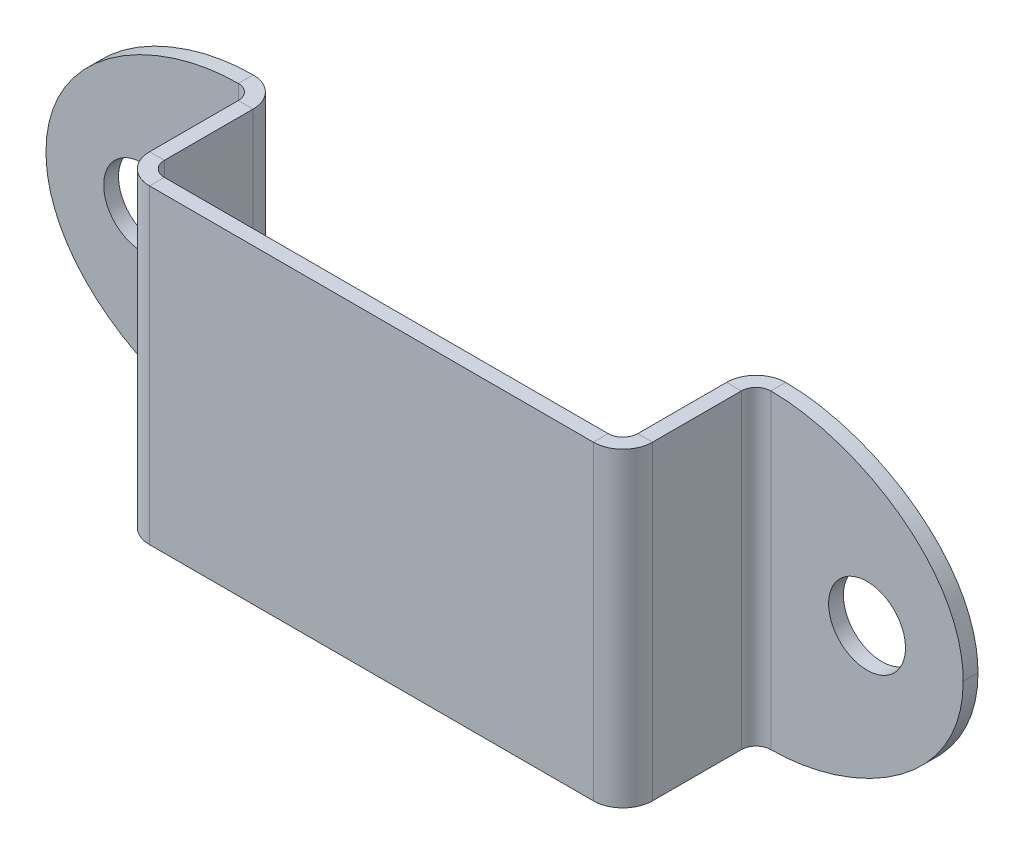
ISO-10303-21;
HEADER;
FILE_DESCRIPTION(('STEP AP214'),'2;1');
FILE_NAME('part.step','',(''),(''),'','','');
FILE_SCHEMA(('AUTOMOTIVE_DESIGN { 1 0 10303 214 1 1 1 1 }'));
ENDSEC;
DATA;
#1=APPLICATION_CONTEXT('core data for automotive mechanical design processes');
#2=APPLICATION_PROTOCOL_DEFINITION('international standard','automotive_design',2000,#1);
#3=PRODUCT_CONTEXT('',#1,'mechanical');
#4=PRODUCT('Part','Part','',(#3));
#5=PRODUCT_RELATED_PRODUCT_CATEGORY('part','',(#4));
#6=PRODUCT_DEFINITION_FORMATION('','',#4);
#7=PRODUCT_DEFINITION_CONTEXT('part definition',#1,'design');
#8=PRODUCT_DEFINITION('design','',#6,#7);
#9=PRODUCT_DEFINITION_SHAPE('','',#8);
#10=(LENGTH_UNIT() NAMED_UNIT(*) SI_UNIT(.MILLI.,.METRE.));
#11=(NAMED_UNIT(*) PLANE_ANGLE_UNIT() SI_UNIT($,.RADIAN.));
#12=(NAMED_UNIT(*) SI_UNIT($,.STERADIAN.) SOLID_ANGLE_UNIT());
#13=UNCERTAINTY_MEASURE_WITH_UNIT(LENGTH_MEASURE(1.E-05),#10,'distance_accuracy_value','');
#14=(GEOMETRIC_REPRESENTATION_CONTEXT(3) GLOBAL_UNCERTAINTY_ASSIGNED_CONTEXT((#13)) GLOBAL_UNIT_ASSIGNED_CONTEXT((#10,
#11,#12)) REPRESENTATION_CONTEXT('',''));
#15=CARTESIAN_POINT('',(0.,0.,0.));
#16=DIRECTION('',(0.,0.,1.));
#17=DIRECTION('',(1.,0.,0.));
#18=AXIS2_PLACEMENT_3D('',#15,#16,#17);
#19=CARTESIAN_POINT('',(16.,21.,1.));
#20=DIRECTION('',(0.,0.,-1.));
#21=DIRECTION('',(-1.,0.,0.));
#22=AXIS2_PLACEMENT_3D('',#19,#20,#21);
#23=PLANE('',#22);
#24=CARTESIAN_POINT('',(24.5,10.5,1.00000000000001));
#25=DIRECTION('',(0.,0.,1.));
#26=DIRECTION('',(-1.,0.,0.));
#27=AXIS2_PLACEMENT_3D('',#24,#25,#26);
#28=CIRCLE('',#27,2.6);
#29=CARTESIAN_POINT('',(21.9,10.5,1.00000000000001));
#30=VERTEX_POINT('',#29);
#31=EDGE_CURVE('E904',#30,#30,#28,.T.);
#32=ORIENTED_EDGE('',*,*,#31,.F.);
#33=EDGE_LOOP('',(#32));
#34=FACE_BOUND('',#33,.T.);
#35=CARTESIAN_POINT('',(18.,21.,1.00000000000001));
#36=CARTESIAN_POINT('',(23.8406079071876,21.,1.00000000000001));
#37=CARTESIAN_POINT('',(31.,16.8315231890878,1.00000000000001));
#38=CARTESIAN_POINT('',(31.,10.5,1.00000000000001));
#39=B_SPLINE_CURVE_WITH_KNOTS('',3,(#35,#36,#37,#38),.UNSPECIFIED.,.F.,.F.,(4,4),(0.,1.),.UNSPECIFIED.);
#40=CARTESIAN_POINT('',(18.,21.,1.00000000000001));
#41=VERTEX_POINT('',#40);
#42=CARTESIAN_POINT('',(31.,10.5,1.00000000000001));
#43=VERTEX_POINT('',#42);
#44=EDGE_CURVE('E434',#41,#43,#39,.T.);
#45=ORIENTED_EDGE('',*,*,#44,.F.);
#46=DIRECTION('',(0.,-1.,0.));
#47=VECTOR('',#46,1.);
#48=CARTESIAN_POINT('',(18.,21.,0.999999999999999));
#49=LINE('',#48,#47);
#50=CARTESIAN_POINT('',(18.,0.,0.999999999999999));
#51=VERTEX_POINT('',#50);
#52=EDGE_CURVE('E194',#41,#51,#49,.T.);
#53=ORIENTED_EDGE('',*,*,#52,.T.);
#54=CARTESIAN_POINT('',(31.,10.5,1.00000000000001));
#55=CARTESIAN_POINT('',(31.,4.16847681091217,1.00000000000001));
#56=CARTESIAN_POINT('',(23.8406079071876,0.,1.00000000000001));
#57=CARTESIAN_POINT('',(18.,0.,1.00000000000001));
#58=B_SPLINE_CURVE_WITH_KNOTS('',3,(#54,#55,#56,#57),.UNSPECIFIED.,.F.,.F.,(4,4),(0.,1.),.UNSPECIFIED.);
#59=EDGE_CURVE('E111',#43,#51,#58,.T.);
#60=ORIENTED_EDGE('',*,*,#59,.F.);
#61=EDGE_LOOP('',(#45,#53,#60));
#62=FACE_BOUND('',#61,.T.);
#63=ADVANCED_FACE('F38',(#34,#62),#23,.F.);
#64=CARTESIAN_POINT('',(16.,21.,0.));
#65=DIRECTION('',(0.,0.,-1.));
#66=DIRECTION('',(-1.,0.,0.));
#67=AXIS2_PLACEMENT_3D('',#64,#65,#66);
#68=PLANE('',#67);
#69=CARTESIAN_POINT('',(24.5,10.5,0.));
#70=DIRECTION('',(0.,0.,1.));
#71=DIRECTION('',(-1.,0.,0.));
#72=AXIS2_PLACEMENT_3D('',#69,#70,#71);
#73=CIRCLE('',#72,2.6);
#74=CARTESIAN_POINT('',(21.9,10.5,0.));
#75=VERTEX_POINT('',#74);
#76=EDGE_CURVE('E905',#75,#75,#73,.T.);
#77=ORIENTED_EDGE('',*,*,#76,.T.);
#78=EDGE_LOOP('',(#77));
#79=FACE_BOUND('',#78,.T.);
#80=DIRECTION('',(0.,-1.,0.));
#81=VECTOR('',#80,1.);
#82=CARTESIAN_POINT('',(18.,21.,0.));
#83=LINE('',#82,#81);
#84=CARTESIAN_POINT('',(18.,21.,0.));
#85=VERTEX_POINT('',#84);
#86=CARTESIAN_POINT('',(18.,0.,0.));
#87=VERTEX_POINT('',#86);
#88=EDGE_CURVE('E271',#85,#87,#83,.T.);
#89=ORIENTED_EDGE('',*,*,#88,.F.);
#90=CARTESIAN_POINT('',(18.,21.,0.));
#91=CARTESIAN_POINT('',(23.8406079071876,21.,0.));
#92=CARTESIAN_POINT('',(31.,16.8315231890878,0.));
#93=CARTESIAN_POINT('',(31.,10.5,0.));
#94=B_SPLINE_CURVE_WITH_KNOTS('',3,(#90,#91,#92,#93),.UNSPECIFIED.,.F.,.F.,(4,4),(0.,1.),.UNSPECIFIED.);
#95=CARTESIAN_POINT('',(31.,10.5,0.));
#96=VERTEX_POINT('',#95);
#97=EDGE_CURVE('E436',#85,#96,#94,.T.);
#98=ORIENTED_EDGE('',*,*,#97,.T.);
#99=CARTESIAN_POINT('',(31.,10.5,0.));
#100=CARTESIAN_POINT('',(31.,4.16847681091217,0.));
#101=CARTESIAN_POINT('',(23.8406079071876,0.,0.));
#102=CARTESIAN_POINT('',(18.,0.,0.));
#103=B_SPLINE_CURVE_WITH_KNOTS('',3,(#99,#100,#101,#102),.UNSPECIFIED.,.F.,.F.,(4,4),(0.,1.),.UNSPECIFIED.);
#104=EDGE_CURVE('E450',#96,#87,#103,.T.);
#105=ORIENTED_EDGE('',*,*,#104,.T.);
#106=EDGE_LOOP('',(#89,#98,#105));
#107=FACE_BOUND('',#106,.T.);
#108=ADVANCED_FACE('F452',(#79,#107),#68,.T.);
#109=CARTESIAN_POINT('',(-31.,21.,0.));
#110=DIRECTION('',(0.,0.,-1.));
#111=DIRECTION('',(-1.,0.,0.));
#112=AXIS2_PLACEMENT_3D('',#109,#110,#111);
#113=PLANE('',#112);
#114=CARTESIAN_POINT('',(-24.5,10.5,0.));
#115=DIRECTION('',(0.,0.,1.));
#116=DIRECTION('',(1.,0.,0.));
#117=AXIS2_PLACEMENT_3D('',#114,#115,#116);
#118=CIRCLE('',#117,2.6);
#119=CARTESIAN_POINT('',(-21.9,10.5,0.));
#120=VERTEX_POINT('',#119);
#121=EDGE_CURVE('E199',#120,#120,#118,.T.);
#122=ORIENTED_EDGE('',*,*,#121,.T.);
#123=EDGE_LOOP('',(#122));
#124=FACE_BOUND('',#123,.T.);
#125=CARTESIAN_POINT('',(-18.,0.,0.));
#126=CARTESIAN_POINT('',(-23.8406079071876,0.,0.));
#127=CARTESIAN_POINT('',(-31.,4.16847681091217,0.));
#128=CARTESIAN_POINT('',(-31.,10.5,0.));
#129=B_SPLINE_CURVE_WITH_KNOTS('',3,(#125,#126,#127,#128),.UNSPECIFIED.,.F.,.F.,(4,4),(0.,1.),.UNSPECIFIED.);
#130=CARTESIAN_POINT('',(-18.,0.,0.));
#131=VERTEX_POINT('',#130);
#132=CARTESIAN_POINT('',(-31.,10.5,0.));
#133=VERTEX_POINT('',#132);
#134=EDGE_CURVE('E320',#131,#133,#129,.T.);
#135=ORIENTED_EDGE('',*,*,#134,.T.);
#136=CARTESIAN_POINT('',(-31.,10.5,0.));
#137=CARTESIAN_POINT('',(-31.,16.8315231890878,0.));
#138=CARTESIAN_POINT('',(-23.8406079071876,21.,0.));
#139=CARTESIAN_POINT('',(-18.,21.,0.));
#140=B_SPLINE_CURVE_WITH_KNOTS('',3,(#136,#137,#138,#139),.UNSPECIFIED.,.F.,.F.,(4,4),(0.,1.),.UNSPECIFIED.);
#141=CARTESIAN_POINT('',(-18.,21.,0.));
#142=VERTEX_POINT('',#141);
#143=EDGE_CURVE('E304',#133,#142,#140,.T.);
#144=ORIENTED_EDGE('',*,*,#143,.T.);
#145=DIRECTION('',(0.,-1.,0.));
#146=VECTOR('',#145,1.);
#147=CARTESIAN_POINT('',(-18.,21.,0.));
#148=LINE('',#147,#146);
#149=EDGE_CURVE('E250',#142,#131,#148,.T.);
#150=ORIENTED_EDGE('',*,*,#149,.T.);
#151=EDGE_LOOP('',(#135,#144,#150));
#152=FACE_BOUND('',#151,.T.);
#153=ADVANCED_FACE('F317',(#124,#152),#113,.T.);
#154=CARTESIAN_POINT('',(-31.,21.,1.));
#155=DIRECTION('',(0.,0.,-1.));
#156=DIRECTION('',(-1.,0.,0.));
#157=AXIS2_PLACEMENT_3D('',#154,#155,#156);
#158=PLANE('',#157);
#159=CARTESIAN_POINT('',(-24.5,10.5,1.00000000000001));
#160=DIRECTION('',(0.,0.,1.));
#161=DIRECTION('',(1.,0.,0.));
#162=AXIS2_PLACEMENT_3D('',#159,#160,#161);
#163=CIRCLE('',#162,2.6);
#164=CARTESIAN_POINT('',(-21.9,10.5,1.00000000000001));
#165=VERTEX_POINT('',#164);
#166=EDGE_CURVE('E908',#165,#165,#163,.T.);
#167=ORIENTED_EDGE('',*,*,#166,.F.);
#168=EDGE_LOOP('',(#167));
#169=FACE_BOUND('',#168,.T.);
#170=CARTESIAN_POINT('',(-31.,10.5,1.00000000000001));
#171=CARTESIAN_POINT('',(-31.,16.8315231890878,1.00000000000001));
#172=CARTESIAN_POINT('',(-23.8406079071876,21.,1.00000000000001));
#173=CARTESIAN_POINT('',(-18.,21.,1.00000000000001));
#174=B_SPLINE_CURVE_WITH_KNOTS('',3,(#170,#171,#172,#173),.UNSPECIFIED.,.F.,.F.,(4,4),(0.,1.),.UNSPECIFIED.);
#175=CARTESIAN_POINT('',(-31.,10.5,1.00000000000001));
#176=VERTEX_POINT('',#175);
#177=CARTESIAN_POINT('',(-18.,21.,1.));
#178=VERTEX_POINT('',#177);
#179=EDGE_CURVE('E308',#176,#178,#174,.T.);
#180=ORIENTED_EDGE('',*,*,#179,.F.);
#181=CARTESIAN_POINT('',(-18.,0.,1.00000000000001));
#182=CARTESIAN_POINT('',(-23.8406079071876,0.,1.00000000000001));
#183=CARTESIAN_POINT('',(-31.,4.16847681091217,1.00000000000001));
#184=CARTESIAN_POINT('',(-31.,10.5,1.00000000000001));
#185=B_SPLINE_CURVE_WITH_KNOTS('',3,(#181,#182,#183,#184),.UNSPECIFIED.,.F.,.F.,(4,4),(0.,1.),.UNSPECIFIED.);
#186=CARTESIAN_POINT('',(-18.,0.,1.));
#187=VERTEX_POINT('',#186);
#188=EDGE_CURVE('E407',#187,#176,#185,.T.);
#189=ORIENTED_EDGE('',*,*,#188,.F.);
#190=DIRECTION('',(0.,-1.,0.));
#191=VECTOR('',#190,1.);
#192=CARTESIAN_POINT('',(-18.,21.,1.));
#193=LINE('',#192,#191);
#194=EDGE_CURVE('E247',#178,#187,#193,.T.);
#195=ORIENTED_EDGE('',*,*,#194,.F.);
#196=EDGE_LOOP('',(#180,#189,#195));
#197=FACE_BOUND('',#196,.T.);
#198=ADVANCED_FACE('F409',(#169,#197),#158,.F.);
#199=CARTESIAN_POINT('',(-16.,21.,2.));
#200=DIRECTION('',(0.,1.,0.));
#201=DIRECTION('',(0.,0.,1.));
#202=AXIS2_PLACEMENT_3D('',#199,#200,#201);
#203=PLANE('',#202);
#204=DIRECTION('',(-1.,0.,0.));
#205=VECTOR('',#204,1.);
#206=CARTESIAN_POINT('',(-16.,21.,2.));
#207=LINE('',#206,#205);
#208=CARTESIAN_POINT('',(-16.,21.,2.));
#209=VERTEX_POINT('',#208);
#210=CARTESIAN_POINT('',(-17.,21.,2.));
#211=VERTEX_POINT('',#210);
#212=EDGE_CURVE('E11',#209,#211,#207,.T.);
#213=ORIENTED_EDGE('',*,*,#212,.F.);
#214=CARTESIAN_POINT('',(-18.,21.,2.));
#215=DIRECTION('',(0.,1.,0.));
#216=DIRECTION('',(0.,0.,1.));
#217=AXIS2_PLACEMENT_3D('',#214,#215,#216);
#218=CIRCLE('',#217,2.);
#219=EDGE_CURVE('E326',#142,#209,#218,.F.);
#220=ORIENTED_EDGE('',*,*,#219,.F.);
#221=DIRECTION('',(0.,0.,-1.));
#222=VECTOR('',#221,1.);
#223=CARTESIAN_POINT('',(-18.,21.,1.));
#224=LINE('',#223,#222);
#225=EDGE_CURVE('E47',#178,#142,#224,.T.);
#226=ORIENTED_EDGE('',*,*,#225,.F.);
#227=CARTESIAN_POINT('',(-18.,21.,2.));
#228=DIRECTION('',(0.,1.,0.));
#229=DIRECTION('',(1.,0.,0.));
#230=AXIS2_PLACEMENT_3D('',#227,#228,#229);
#231=CIRCLE('',#230,1.);
#232=EDGE_CURVE('E328',#178,#211,#231,.F.);
#233=ORIENTED_EDGE('',*,*,#232,.T.);
#234=EDGE_LOOP('',(#213,#220,#226,#233));
#235=FACE_BOUND('',#234,.T.);
#236=ADVANCED_FACE('F40',(#235),#203,.T.);
#237=CARTESIAN_POINT('',(-18.,21.,1.));
#238=DIRECTION('',(0.,1.,0.));
#239=DIRECTION('',(0.,0.,1.));
#240=AXIS2_PLACEMENT_3D('',#237,#238,#239);
#241=PLANE('',#240);
#242=DIRECTION('',(0.,0.,1.));
#243=VECTOR('',#242,1.);
#244=CARTESIAN_POINT('',(-16.,21.,0.));
#245=LINE('',#244,#243);
#246=CARTESIAN_POINT('',(-16.,21.,8.00000000000001));
#247=VERTEX_POINT('',#246);
#248=EDGE_CURVE('E329',#209,#247,#245,.T.);
#249=ORIENTED_EDGE('',*,*,#248,.F.);
#250=ORIENTED_EDGE('',*,*,#212,.T.);
#251=DIRECTION('',(0.,0.,-1.));
#252=VECTOR('',#251,1.);
#253=CARTESIAN_POINT('',(-17.,21.,0.));
#254=LINE('',#253,#252);
#255=CARTESIAN_POINT('',(-17.,21.,8.00000000000001));
#256=VERTEX_POINT('',#255);
#257=EDGE_CURVE('E331',#211,#256,#254,.F.);
#258=ORIENTED_EDGE('',*,*,#257,.T.);
#259=DIRECTION('',(1.,0.,0.));
#260=VECTOR('',#259,1.);
#261=CARTESIAN_POINT('',(-17.,21.,8.00000000000001));
#262=LINE('',#261,#260);
#263=EDGE_CURVE('E289',#256,#247,#262,.T.);
#264=ORIENTED_EDGE('',*,*,#263,.T.);
#265=EDGE_LOOP('',(#249,#250,#258,#264));
#266=FACE_BOUND('',#265,.T.);
#267=ADVANCED_FACE('F388',(#266),#241,.T.);
#268=CARTESIAN_POINT('',(-18.,0.,0.));
#269=DIRECTION('',(0.,-1.,0.));
#270=DIRECTION('',(0.,0.,-1.));
#271=AXIS2_PLACEMENT_3D('',#268,#269,#270);
#272=PLANE('',#271);
#273=DIRECTION('',(0.,0.,1.));
#274=VECTOR('',#273,1.);
#275=CARTESIAN_POINT('',(-18.,0.,0.));
#276=LINE('',#275,#274);
#277=EDGE_CURVE('E294',#131,#187,#276,.T.);
#278=ORIENTED_EDGE('',*,*,#277,.F.);
#279=CARTESIAN_POINT('',(-18.,0.,2.));
#280=DIRECTION('',(0.,1.,0.));
#281=DIRECTION('',(0.,0.,1.));
#282=AXIS2_PLACEMENT_3D('',#279,#280,#281);
#283=CIRCLE('',#282,2.);
#284=CARTESIAN_POINT('',(-16.,0.,2.));
#285=VERTEX_POINT('',#284);
#286=EDGE_CURVE('E213',#131,#285,#283,.F.);
#287=ORIENTED_EDGE('',*,*,#286,.T.);
#288=DIRECTION('',(1.,0.,0.));
#289=VECTOR('',#288,1.);
#290=CARTESIAN_POINT('',(-17.,0.,2.));
#291=LINE('',#290,#289);
#292=CARTESIAN_POINT('',(-17.,0.,2.));
#293=VERTEX_POINT('',#292);
#294=EDGE_CURVE('E292',#293,#285,#291,.T.);
#295=ORIENTED_EDGE('',*,*,#294,.F.);
#296=CARTESIAN_POINT('',(-18.,0.,2.));
#297=DIRECTION('',(0.,1.,0.));
#298=DIRECTION('',(1.,0.,0.));
#299=AXIS2_PLACEMENT_3D('',#296,#297,#298);
#300=CIRCLE('',#299,1.);
#301=EDGE_CURVE('E216',#187,#293,#300,.F.);
#302=ORIENTED_EDGE('',*,*,#301,.F.);
#303=EDGE_LOOP('',(#278,#287,#295,#302));
#304=FACE_BOUND('',#303,.T.);
#305=ADVANCED_FACE('F400',(#304),#272,.T.);
#306=CARTESIAN_POINT('',(-15.,21.,9.00000000000001));
#307=DIRECTION('',(0.,1.,0.));
#308=DIRECTION('',(0.,0.,1.));
#309=AXIS2_PLACEMENT_3D('',#306,#307,#308);
#310=PLANE('',#309);
#311=DIRECTION('',(0.,0.,1.));
#312=VECTOR('',#311,1.);
#313=CARTESIAN_POINT('',(-15.,21.,9.00000000000001));
#314=LINE('',#313,#312);
#315=CARTESIAN_POINT('',(-15.,21.,9.00000000000001));
#316=VERTEX_POINT('',#315);
#317=CARTESIAN_POINT('',(-15.,21.,10.));
#318=VERTEX_POINT('',#317);
#319=EDGE_CURVE('E166',#316,#318,#314,.T.);
#320=ORIENTED_EDGE('',*,*,#319,.F.);
#321=CARTESIAN_POINT('',(-15.,21.,8.00000000000001));
#322=DIRECTION('',(0.,-1.,0.));
#323=DIRECTION('',(0.,0.,-1.));
#324=AXIS2_PLACEMENT_3D('',#321,#322,#323);
#325=CIRCLE('',#324,1.);
#326=EDGE_CURVE('E334',#247,#316,#325,.F.);
#327=ORIENTED_EDGE('',*,*,#326,.F.);
#328=ORIENTED_EDGE('',*,*,#263,.F.);
#329=CARTESIAN_POINT('',(-15.,21.,8.00000000000001));
#330=DIRECTION('',(0.,1.,0.));
#331=DIRECTION('',(1.,0.,0.));
#332=AXIS2_PLACEMENT_3D('',#329,#330,#331);
#333=CIRCLE('',#332,2.);
#334=EDGE_CURVE('E170',#256,#318,#333,.T.);
#335=ORIENTED_EDGE('',*,*,#334,.T.);
#336=EDGE_LOOP('',(#320,#327,#328,#335));
#337=FACE_BOUND('',#336,.T.);
#338=ADVANCED_FACE('F342',(#337),#310,.T.);
#339=CARTESIAN_POINT('',(-17.,21.,8.00000000000001));
#340=DIRECTION('',(0.,1.,0.));
#341=DIRECTION('',(0.,0.,1.));
#342=AXIS2_PLACEMENT_3D('',#339,#340,#341);
#343=PLANE('',#342);
#344=DIRECTION('',(1.,0.,0.));
#345=VECTOR('',#344,1.);
#346=CARTESIAN_POINT('',(-16.,21.,9.00000000000001));
#347=LINE('',#346,#345);
#348=CARTESIAN_POINT('',(15.,21.,9.));
#349=VERTEX_POINT('',#348);
#350=EDGE_CURVE('E356',#316,#349,#347,.T.);
#351=ORIENTED_EDGE('',*,*,#350,.F.);
#352=ORIENTED_EDGE('',*,*,#319,.T.);
#353=DIRECTION('',(1.,0.,0.));
#354=VECTOR('',#353,1.);
#355=CARTESIAN_POINT('',(-16.,21.,10.));
#356=LINE('',#355,#354);
#357=CARTESIAN_POINT('',(15.,21.,10.));
#358=VERTEX_POINT('',#357);
#359=EDGE_CURVE('E163',#318,#358,#356,.T.);
#360=ORIENTED_EDGE('',*,*,#359,.T.);
#361=DIRECTION('',(0.,0.,-1.));
#362=VECTOR('',#361,1.);
#363=CARTESIAN_POINT('',(15.,21.,10.));
#364=LINE('',#363,#362);
#365=EDGE_CURVE('E147',#358,#349,#364,.T.);
#366=ORIENTED_EDGE('',*,*,#365,.T.);
#367=EDGE_LOOP('',(#351,#352,#360,#366));
#368=FACE_BOUND('',#367,.T.);
#369=ADVANCED_FACE('F165',(#368),#343,.T.);
#370=CARTESIAN_POINT('',(-16.,0.,8.00000000000001));
#371=DIRECTION('',(0.,-1.,0.));
#372=DIRECTION('',(0.,0.,-1.));
#373=AXIS2_PLACEMENT_3D('',#370,#371,#372);
#374=PLANE('',#373);
#375=DIRECTION('',(-1.,0.,0.));
#376=VECTOR('',#375,1.);
#377=CARTESIAN_POINT('',(-16.,0.,8.00000000000001));
#378=LINE('',#377,#376);
#379=CARTESIAN_POINT('',(-16.,0.,8.00000000000001));
#380=VERTEX_POINT('',#379);
#381=CARTESIAN_POINT('',(-17.,0.,8.00000000000001));
#382=VERTEX_POINT('',#381);
#383=EDGE_CURVE('E287',#380,#382,#378,.T.);
#384=ORIENTED_EDGE('',*,*,#383,.F.);
#385=CARTESIAN_POINT('',(-15.,0.,8.00000000000001));
#386=DIRECTION('',(0.,-1.,0.));
#387=DIRECTION('',(0.,0.,-1.));
#388=AXIS2_PLACEMENT_3D('',#385,#386,#387);
#389=CIRCLE('',#388,1.);
#390=CARTESIAN_POINT('',(-15.,0.,9.00000000000001));
#391=VERTEX_POINT('',#390);
#392=EDGE_CURVE('E207',#380,#391,#389,.F.);
#393=ORIENTED_EDGE('',*,*,#392,.T.);
#394=DIRECTION('',(0.,0.,-1.));
#395=VECTOR('',#394,1.);
#396=CARTESIAN_POINT('',(-15.,0.,10.));
#397=LINE('',#396,#395);
#398=CARTESIAN_POINT('',(-15.,0.,10.));
#399=VERTEX_POINT('',#398);
#400=EDGE_CURVE('E285',#399,#391,#397,.T.);
#401=ORIENTED_EDGE('',*,*,#400,.F.);
#402=CARTESIAN_POINT('',(-15.,0.,8.00000000000001));
#403=DIRECTION('',(0.,1.,0.));
#404=DIRECTION('',(1.,0.,0.));
#405=AXIS2_PLACEMENT_3D('',#402,#403,#404);
#406=CIRCLE('',#405,2.);
#407=EDGE_CURVE('E222',#382,#399,#406,.T.);
#408=ORIENTED_EDGE('',*,*,#407,.F.);
#409=EDGE_LOOP('',(#384,#393,#401,#408));
#410=FACE_BOUND('',#409,.T.);
#411=ADVANCED_FACE('F395',(#410),#374,.T.);
#412=CARTESIAN_POINT('',(-15.,0.,10.));
#413=DIRECTION('',(0.,-1.,0.));
#414=DIRECTION('',(0.,0.,-1.));
#415=AXIS2_PLACEMENT_3D('',#412,#413,#414);
#416=PLANE('',#415);
#417=DIRECTION('',(0.,0.,1.));
#418=VECTOR('',#417,1.);
#419=CARTESIAN_POINT('',(-16.,0.,0.));
#420=LINE('',#419,#418);
#421=EDGE_CURVE('E210',#285,#380,#420,.T.);
#422=ORIENTED_EDGE('',*,*,#421,.T.);
#423=ORIENTED_EDGE('',*,*,#383,.T.);
#424=DIRECTION('',(0.,0.,-1.));
#425=VECTOR('',#424,1.);
#426=CARTESIAN_POINT('',(-17.,0.,0.));
#427=LINE('',#426,#425);
#428=EDGE_CURVE('E219',#293,#382,#427,.F.);
#429=ORIENTED_EDGE('',*,*,#428,.F.);
#430=ORIENTED_EDGE('',*,*,#294,.T.);
#431=EDGE_LOOP('',(#422,#423,#429,#430));
#432=FACE_BOUND('',#431,.T.);
#433=ADVANCED_FACE('F397',(#432),#416,.T.);
#434=CARTESIAN_POINT('',(16.,21.,8.));
#435=DIRECTION('',(0.,1.,0.));
#436=DIRECTION('',(0.,0.,1.));
#437=AXIS2_PLACEMENT_3D('',#434,#435,#436);
#438=PLANE('',#437);
#439=DIRECTION('',(1.,0.,0.));
#440=VECTOR('',#439,1.);
#441=CARTESIAN_POINT('',(16.,21.,8.));
#442=LINE('',#441,#440);
#443=CARTESIAN_POINT('',(16.,21.,8.));
#444=VERTEX_POINT('',#443);
#445=CARTESIAN_POINT('',(17.,21.,8.));
#446=VERTEX_POINT('',#445);
#447=EDGE_CURVE('E159',#444,#446,#442,.T.);
#448=ORIENTED_EDGE('',*,*,#447,.F.);
#449=CARTESIAN_POINT('',(15.,21.,8.));
#450=DIRECTION('',(0.,-1.,0.));
#451=DIRECTION('',(0.,0.,-1.));
#452=AXIS2_PLACEMENT_3D('',#449,#450,#451);
#453=CIRCLE('',#452,1.);
#454=EDGE_CURVE('E154',#349,#444,#453,.F.);
#455=ORIENTED_EDGE('',*,*,#454,.F.);
#456=ORIENTED_EDGE('',*,*,#365,.F.);
#457=CARTESIAN_POINT('',(15.,21.,8.));
#458=DIRECTION('',(0.,1.,0.));
#459=DIRECTION('',(1.,0.,0.));
#460=AXIS2_PLACEMENT_3D('',#457,#458,#459);
#461=CIRCLE('',#460,2.);
#462=EDGE_CURVE('E151',#358,#446,#461,.T.);
#463=ORIENTED_EDGE('',*,*,#462,.T.);
#464=EDGE_LOOP('',(#448,#455,#456,#463));
#465=FACE_BOUND('',#464,.T.);
#466=ADVANCED_FACE('F149',(#465),#438,.T.);
#467=CARTESIAN_POINT('',(15.,21.,10.));
#468=DIRECTION('',(0.,1.,0.));
#469=DIRECTION('',(0.,0.,1.));
#470=AXIS2_PLACEMENT_3D('',#467,#468,#469);
#471=PLANE('',#470);
#472=DIRECTION('',(0.,0.,-1.));
#473=VECTOR('',#472,1.);
#474=CARTESIAN_POINT('',(16.,21.,9.));
#475=LINE('',#474,#473);
#476=CARTESIAN_POINT('',(16.,21.,2.));
#477=VERTEX_POINT('',#476);
#478=EDGE_CURVE('E371',#444,#477,#475,.T.);
#479=ORIENTED_EDGE('',*,*,#478,.F.);
#480=ORIENTED_EDGE('',*,*,#447,.T.);
#481=DIRECTION('',(0.,0.,-1.));
#482=VECTOR('',#481,1.);
#483=CARTESIAN_POINT('',(17.,21.,9.));
#484=LINE('',#483,#482);
#485=CARTESIAN_POINT('',(17.,21.,2.));
#486=VERTEX_POINT('',#485);
#487=EDGE_CURVE('E187',#446,#486,#484,.T.);
#488=ORIENTED_EDGE('',*,*,#487,.T.);
#489=DIRECTION('',(-1.,0.,0.));
#490=VECTOR('',#489,1.);
#491=CARTESIAN_POINT('',(17.,21.,2.));
#492=LINE('',#491,#490);
#493=EDGE_CURVE('E55',#486,#477,#492,.T.);
#494=ORIENTED_EDGE('',*,*,#493,.T.);
#495=EDGE_LOOP('',(#479,#480,#488,#494));
#496=FACE_BOUND('',#495,.T.);
#497=ADVANCED_FACE('F370',(#496),#471,.T.);
#498=CARTESIAN_POINT('',(15.,0.,9.));
#499=DIRECTION('',(0.,-1.,0.));
#500=DIRECTION('',(0.,0.,-1.));
#501=AXIS2_PLACEMENT_3D('',#498,#499,#500);
#502=PLANE('',#501);
#503=DIRECTION('',(0.,0.,1.));
#504=VECTOR('',#503,1.);
#505=CARTESIAN_POINT('',(15.,0.,9.));
#506=LINE('',#505,#504);
#507=CARTESIAN_POINT('',(15.,0.,9.));
#508=VERTEX_POINT('',#507);
#509=CARTESIAN_POINT('',(15.,0.,10.));
#510=VERTEX_POINT('',#509);
#511=EDGE_CURVE('E160',#508,#510,#506,.T.);
#512=ORIENTED_EDGE('',*,*,#511,.F.);
#513=CARTESIAN_POINT('',(15.,0.,8.));
#514=DIRECTION('',(0.,-1.,0.));
#515=DIRECTION('',(0.,0.,-1.));
#516=AXIS2_PLACEMENT_3D('',#513,#514,#515);
#517=CIRCLE('',#516,1.);
#518=CARTESIAN_POINT('',(16.,0.,8.));
#519=VERTEX_POINT('',#518);
#520=EDGE_CURVE('E201',#508,#519,#517,.F.);
#521=ORIENTED_EDGE('',*,*,#520,.T.);
#522=DIRECTION('',(-1.,0.,0.));
#523=VECTOR('',#522,1.);
#524=CARTESIAN_POINT('',(17.,0.,8.));
#525=LINE('',#524,#523);
#526=CARTESIAN_POINT('',(17.,0.,8.));
#527=VERTEX_POINT('',#526);
#528=EDGE_CURVE('E281',#527,#519,#525,.T.);
#529=ORIENTED_EDGE('',*,*,#528,.F.);
#530=CARTESIAN_POINT('',(15.,0.,8.));
#531=DIRECTION('',(0.,1.,0.));
#532=DIRECTION('',(1.,0.,0.));
#533=AXIS2_PLACEMENT_3D('',#530,#531,#532);
#534=CIRCLE('',#533,2.);
#535=EDGE_CURVE('E226',#510,#527,#534,.T.);
#536=ORIENTED_EDGE('',*,*,#535,.F.);
#537=EDGE_LOOP('',(#512,#521,#529,#536));
#538=FACE_BOUND('',#537,.T.);
#539=ADVANCED_FACE('F352',(#538),#502,.T.);
#540=CARTESIAN_POINT('',(17.,0.,8.));
#541=DIRECTION('',(0.,-1.,0.));
#542=DIRECTION('',(0.,0.,-1.));
#543=AXIS2_PLACEMENT_3D('',#540,#541,#542);
#544=PLANE('',#543);
#545=DIRECTION('',(1.,0.,0.));
#546=VECTOR('',#545,1.);
#547=CARTESIAN_POINT('',(-16.,0.,9.00000000000001));
#548=LINE('',#547,#546);
#549=EDGE_CURVE('E204',#391,#508,#548,.T.);
#550=ORIENTED_EDGE('',*,*,#549,.T.);
#551=ORIENTED_EDGE('',*,*,#511,.T.);
#552=DIRECTION('',(1.,0.,0.));
#553=VECTOR('',#552,1.);
#554=CARTESIAN_POINT('',(-16.,0.,10.));
#555=LINE('',#554,#553);
#556=EDGE_CURVE('E177',#399,#510,#555,.T.);
#557=ORIENTED_EDGE('',*,*,#556,.F.);
#558=ORIENTED_EDGE('',*,*,#400,.T.);
#559=EDGE_LOOP('',(#550,#551,#557,#558));
#560=FACE_BOUND('',#559,.T.);
#561=ADVANCED_FACE('F349',(#560),#544,.T.);
#562=CARTESIAN_POINT('',(18.,21.,0.));
#563=DIRECTION('',(0.,1.,0.));
#564=DIRECTION('',(0.,0.,1.));
#565=AXIS2_PLACEMENT_3D('',#562,#563,#564);
#566=PLANE('',#565);
#567=DIRECTION('',(0.,0.,1.));
#568=VECTOR('',#567,1.);
#569=CARTESIAN_POINT('',(18.,21.,0.));
#570=LINE('',#569,#568);
#571=EDGE_CURVE('E278',#85,#41,#570,.T.);
#572=ORIENTED_EDGE('',*,*,#571,.F.);
#573=CARTESIAN_POINT('',(18.,21.,2.));
#574=DIRECTION('',(0.,1.,0.));
#575=DIRECTION('',(0.,0.,1.));
#576=AXIS2_PLACEMENT_3D('',#573,#574,#575);
#577=CIRCLE('',#576,2.);
#578=EDGE_CURVE('E233',#477,#85,#577,.F.);
#579=ORIENTED_EDGE('',*,*,#578,.F.);
#580=ORIENTED_EDGE('',*,*,#493,.F.);
#581=CARTESIAN_POINT('',(18.,21.,2.));
#582=DIRECTION('',(0.,1.,0.));
#583=DIRECTION('',(1.,0.,0.));
#584=AXIS2_PLACEMENT_3D('',#581,#582,#583);
#585=CIRCLE('',#584,1.);
#586=EDGE_CURVE('E189',#486,#41,#585,.F.);
#587=ORIENTED_EDGE('',*,*,#586,.T.);
#588=EDGE_LOOP('',(#572,#579,#580,#587));
#589=FACE_BOUND('',#588,.T.);
#590=ADVANCED_FACE('F441',(#589),#566,.T.);
#591=CARTESIAN_POINT('',(16.,0.,2.));
#592=DIRECTION('',(0.,-1.,0.));
#593=DIRECTION('',(0.,0.,-1.));
#594=AXIS2_PLACEMENT_3D('',#591,#592,#593);
#595=PLANE('',#594);
#596=DIRECTION('',(1.,0.,0.));
#597=VECTOR('',#596,1.);
#598=CARTESIAN_POINT('',(16.,0.,2.));
#599=LINE('',#598,#597);
#600=CARTESIAN_POINT('',(16.,0.,2.));
#601=VERTEX_POINT('',#600);
#602=CARTESIAN_POINT('',(17.,0.,2.));
#603=VERTEX_POINT('',#602);
#604=EDGE_CURVE('E103',#601,#603,#599,.T.);
#605=ORIENTED_EDGE('',*,*,#604,.F.);
#606=CARTESIAN_POINT('',(18.,0.,2.));
#607=DIRECTION('',(0.,1.,0.));
#608=DIRECTION('',(0.,0.,1.));
#609=AXIS2_PLACEMENT_3D('',#606,#607,#608);
#610=CIRCLE('',#609,2.);
#611=EDGE_CURVE('E195',#601,#87,#610,.F.);
#612=ORIENTED_EDGE('',*,*,#611,.T.);
#613=DIRECTION('',(0.,0.,-1.));
#614=VECTOR('',#613,1.);
#615=CARTESIAN_POINT('',(18.,0.,0.999999999999999));
#616=LINE('',#615,#614);
#617=EDGE_CURVE('E274',#51,#87,#616,.T.);
#618=ORIENTED_EDGE('',*,*,#617,.F.);
#619=CARTESIAN_POINT('',(18.,0.,2.));
#620=DIRECTION('',(0.,1.,0.));
#621=DIRECTION('',(1.,0.,0.));
#622=AXIS2_PLACEMENT_3D('',#619,#620,#621);
#623=CIRCLE('',#622,1.);
#624=EDGE_CURVE('E230',#603,#51,#623,.F.);
#625=ORIENTED_EDGE('',*,*,#624,.F.);
#626=EDGE_LOOP('',(#605,#612,#618,#625));
#627=FACE_BOUND('',#626,.T.);
#628=ADVANCED_FACE('F446',(#627),#595,.T.);
#629=CARTESIAN_POINT('',(18.,0.,0.999999999999999));
#630=DIRECTION('',(0.,-1.,0.));
#631=DIRECTION('',(0.,0.,-1.));
#632=AXIS2_PLACEMENT_3D('',#629,#630,#631);
#633=PLANE('',#632);
#634=DIRECTION('',(0.,0.,-1.));
#635=VECTOR('',#634,1.);
#636=CARTESIAN_POINT('',(16.,0.,9.));
#637=LINE('',#636,#635);
#638=EDGE_CURVE('E198',#519,#601,#637,.T.);
#639=ORIENTED_EDGE('',*,*,#638,.T.);
#640=ORIENTED_EDGE('',*,*,#604,.T.);
#641=DIRECTION('',(0.,0.,-1.));
#642=VECTOR('',#641,1.);
#643=CARTESIAN_POINT('',(17.,0.,9.));
#644=LINE('',#643,#642);
#645=EDGE_CURVE('E228',#527,#603,#644,.T.);
#646=ORIENTED_EDGE('',*,*,#645,.F.);
#647=ORIENTED_EDGE('',*,*,#528,.T.);
#648=EDGE_LOOP('',(#639,#640,#646,#647));
#649=FACE_BOUND('',#648,.T.);
#650=ADVANCED_FACE('F365',(#649),#633,.T.);
#651=CARTESIAN_POINT('',(18.,21.,2.));
#652=DIRECTION('',(0.,-1.,0.));
#653=DIRECTION('',(0.,0.,-1.));
#654=AXIS2_PLACEMENT_3D('',#651,#652,#653);
#655=CYLINDRICAL_SURFACE('',#654,2.);
#656=ORIENTED_EDGE('',*,*,#611,.F.);
#657=DIRECTION('',(0.,-1.,0.));
#658=VECTOR('',#657,1.);
#659=CARTESIAN_POINT('',(16.,21.,2.));
#660=LINE('',#659,#658);
#661=EDGE_CURVE('E268',#477,#601,#660,.T.);
#662=ORIENTED_EDGE('',*,*,#661,.F.);
#663=ORIENTED_EDGE('',*,*,#578,.T.);
#664=ORIENTED_EDGE('',*,*,#88,.T.);
#665=EDGE_LOOP('',(#656,#662,#663,#664));
#666=FACE_BOUND('',#665,.T.);
#667=ADVANCED_FACE('F455',(#666),#655,.T.);
#668=CARTESIAN_POINT('',(16.,21.,9.));
#669=DIRECTION('',(-1.,0.,0.));
#670=DIRECTION('',(0.,0.,1.));
#671=AXIS2_PLACEMENT_3D('',#668,#669,#670);
#672=PLANE('',#671);
#673=ORIENTED_EDGE('',*,*,#638,.F.);
#674=DIRECTION('',(0.,-1.,0.));
#675=VECTOR('',#674,1.);
#676=CARTESIAN_POINT('',(16.,21.,8.));
#677=LINE('',#676,#675);
#678=EDGE_CURVE('E265',#444,#519,#677,.T.);
#679=ORIENTED_EDGE('',*,*,#678,.F.);
#680=ORIENTED_EDGE('',*,*,#478,.T.);
#681=ORIENTED_EDGE('',*,*,#661,.T.);
#682=EDGE_LOOP('',(#673,#679,#680,#681));
#683=FACE_BOUND('',#682,.T.);
#684=ADVANCED_FACE('F363',(#683),#672,.T.);
#685=CARTESIAN_POINT('',(15.,21.,8.));
#686=DIRECTION('',(0.,-1.,0.));
#687=DIRECTION('',(0.,0.,-1.));
#688=AXIS2_PLACEMENT_3D('',#685,#686,#687);
#689=CYLINDRICAL_SURFACE('',#688,1.);
#690=ORIENTED_EDGE('',*,*,#520,.F.);
#691=DIRECTION('',(0.,-1.,0.));
#692=VECTOR('',#691,1.);
#693=CARTESIAN_POINT('',(15.,21.,9.));
#694=LINE('',#693,#692);
#695=EDGE_CURVE('E262',#349,#508,#694,.T.);
#696=ORIENTED_EDGE('',*,*,#695,.F.);
#697=ORIENTED_EDGE('',*,*,#454,.T.);
#698=ORIENTED_EDGE('',*,*,#678,.T.);
#699=EDGE_LOOP('',(#690,#696,#697,#698));
#700=FACE_BOUND('',#699,.T.);
#701=ADVANCED_FACE('F358',(#700),#689,.F.);
#702=CARTESIAN_POINT('',(-16.,21.,9.00000000000001));
#703=DIRECTION('',(0.,0.,-1.));
#704=DIRECTION('',(-1.,0.,0.));
#705=AXIS2_PLACEMENT_3D('',#702,#703,#704);
#706=PLANE('',#705);
#707=ORIENTED_EDGE('',*,*,#549,.F.);
#708=DIRECTION('',(0.,-1.,0.));
#709=VECTOR('',#708,1.);
#710=CARTESIAN_POINT('',(-15.,21.,9.00000000000001));
#711=LINE('',#710,#709);
#712=EDGE_CURVE('E259',#316,#391,#711,.T.);
#713=ORIENTED_EDGE('',*,*,#712,.F.);
#714=ORIENTED_EDGE('',*,*,#350,.T.);
#715=ORIENTED_EDGE('',*,*,#695,.T.);
#716=EDGE_LOOP('',(#707,#713,#714,#715));
#717=FACE_BOUND('',#716,.T.);
#718=ADVANCED_FACE('F355',(#717),#706,.T.);
#719=CARTESIAN_POINT('',(-15.,21.,8.00000000000001));
#720=DIRECTION('',(0.,-1.,0.));
#721=DIRECTION('',(0.,0.,-1.));
#722=AXIS2_PLACEMENT_3D('',#719,#720,#721);
#723=CYLINDRICAL_SURFACE('',#722,1.);
#724=ORIENTED_EDGE('',*,*,#392,.F.);
#725=DIRECTION('',(0.,-1.,0.));
#726=VECTOR('',#725,1.);
#727=CARTESIAN_POINT('',(-16.,21.,8.00000000000001));
#728=LINE('',#727,#726);
#729=EDGE_CURVE('E256',#247,#380,#728,.T.);
#730=ORIENTED_EDGE('',*,*,#729,.F.);
#731=ORIENTED_EDGE('',*,*,#326,.T.);
#732=ORIENTED_EDGE('',*,*,#712,.T.);
#733=EDGE_LOOP('',(#724,#730,#731,#732));
#734=FACE_BOUND('',#733,.T.);
#735=ADVANCED_FACE('F382',(#734),#723,.F.);
#736=CARTESIAN_POINT('',(-16.,21.,0.));
#737=DIRECTION('',(1.,0.,0.));
#738=DIRECTION('',(0.,0.,-1.));
#739=AXIS2_PLACEMENT_3D('',#736,#737,#738);
#740=PLANE('',#739);
#741=ORIENTED_EDGE('',*,*,#421,.F.);
#742=DIRECTION('',(0.,-1.,0.));
#743=VECTOR('',#742,1.);
#744=CARTESIAN_POINT('',(-16.,21.,2.));
#745=LINE('',#744,#743);
#746=EDGE_CURVE('E253',#209,#285,#745,.T.);
#747=ORIENTED_EDGE('',*,*,#746,.F.);
#748=ORIENTED_EDGE('',*,*,#248,.T.);
#749=ORIENTED_EDGE('',*,*,#729,.T.);
#750=EDGE_LOOP('',(#741,#747,#748,#749));
#751=FACE_BOUND('',#750,.T.);
#752=ADVANCED_FACE('F386',(#751),#740,.T.);
#753=CARTESIAN_POINT('',(-18.,21.,2.));
#754=DIRECTION('',(0.,-1.,0.));
#755=DIRECTION('',(0.,0.,-1.));
#756=AXIS2_PLACEMENT_3D('',#753,#754,#755);
#757=CYLINDRICAL_SURFACE('',#756,2.);
#758=ORIENTED_EDGE('',*,*,#286,.F.);
#759=ORIENTED_EDGE('',*,*,#149,.F.);
#760=ORIENTED_EDGE('',*,*,#219,.T.);
#761=ORIENTED_EDGE('',*,*,#746,.T.);
#762=EDGE_LOOP('',(#758,#759,#760,#761));
#763=FACE_BOUND('',#762,.T.);
#764=ADVANCED_FACE('F325',(#763),#757,.T.);
#765=CARTESIAN_POINT('',(-18.,21.,2.));
#766=DIRECTION('',(0.,-1.,0.));
#767=DIRECTION('',(0.,0.,-1.));
#768=AXIS2_PLACEMENT_3D('',#765,#766,#767);
#769=CYLINDRICAL_SURFACE('',#768,1.);
#770=ORIENTED_EDGE('',*,*,#301,.T.);
#771=DIRECTION('',(0.,-1.,0.));
#772=VECTOR('',#771,1.);
#773=CARTESIAN_POINT('',(-17.,21.,2.));
#774=LINE('',#773,#772);
#775=EDGE_CURVE('E244',#211,#293,#774,.T.);
#776=ORIENTED_EDGE('',*,*,#775,.F.);
#777=ORIENTED_EDGE('',*,*,#232,.F.);
#778=ORIENTED_EDGE('',*,*,#194,.T.);
#779=EDGE_LOOP('',(#770,#776,#777,#778));
#780=FACE_BOUND('',#779,.T.);
#781=ADVANCED_FACE('F413',(#780),#769,.F.);
#782=CARTESIAN_POINT('',(-17.,21.,0.));
#783=DIRECTION('',(1.,0.,0.));
#784=DIRECTION('',(0.,0.,-1.));
#785=AXIS2_PLACEMENT_3D('',#782,#783,#784);
#786=PLANE('',#785);
#787=ORIENTED_EDGE('',*,*,#428,.T.);
#788=DIRECTION('',(0.,-1.,0.));
#789=VECTOR('',#788,1.);
#790=CARTESIAN_POINT('',(-17.,21.,8.00000000000001));
#791=LINE('',#790,#789);
#792=EDGE_CURVE('E241',#256,#382,#791,.T.);
#793=ORIENTED_EDGE('',*,*,#792,.F.);
#794=ORIENTED_EDGE('',*,*,#257,.F.);
#795=ORIENTED_EDGE('',*,*,#775,.T.);
#796=EDGE_LOOP('',(#787,#793,#794,#795));
#797=FACE_BOUND('',#796,.T.);
#798=ADVANCED_FACE('F392',(#797),#786,.F.);
#799=CARTESIAN_POINT('',(-15.,21.,8.00000000000001));
#800=DIRECTION('',(0.,-1.,0.));
#801=DIRECTION('',(0.,0.,-1.));
#802=AXIS2_PLACEMENT_3D('',#799,#800,#801);
#803=CYLINDRICAL_SURFACE('',#802,2.);
#804=ORIENTED_EDGE('',*,*,#407,.T.);
#805=DIRECTION('',(0.,-1.,0.));
#806=VECTOR('',#805,1.);
#807=CARTESIAN_POINT('',(-15.,21.,10.));
#808=LINE('',#807,#806);
#809=EDGE_CURVE('E181',#318,#399,#808,.T.);
#810=ORIENTED_EDGE('',*,*,#809,.F.);
#811=ORIENTED_EDGE('',*,*,#334,.F.);
#812=ORIENTED_EDGE('',*,*,#792,.T.);
#813=EDGE_LOOP('',(#804,#810,#811,#812));
#814=FACE_BOUND('',#813,.T.);
#815=ADVANCED_FACE('F346',(#814),#803,.T.);
#816=CARTESIAN_POINT('',(-16.,21.,10.));
#817=DIRECTION('',(0.,0.,-1.));
#818=DIRECTION('',(-1.,0.,0.));
#819=AXIS2_PLACEMENT_3D('',#816,#817,#818);
#820=PLANE('',#819);
#821=ORIENTED_EDGE('',*,*,#556,.T.);
#822=DIRECTION('',(0.,-1.,0.));
#823=VECTOR('',#822,1.);
#824=CARTESIAN_POINT('',(15.,21.,10.));
#825=LINE('',#824,#823);
#826=EDGE_CURVE('E174',#358,#510,#825,.T.);
#827=ORIENTED_EDGE('',*,*,#826,.F.);
#828=ORIENTED_EDGE('',*,*,#359,.F.);
#829=ORIENTED_EDGE('',*,*,#809,.T.);
#830=EDGE_LOOP('',(#821,#827,#828,#829));
#831=FACE_BOUND('',#830,.T.);
#832=ADVANCED_FACE('F175',(#831),#820,.F.);
#833=CARTESIAN_POINT('',(15.,21.,8.));
#834=DIRECTION('',(0.,-1.,0.));
#835=DIRECTION('',(0.,0.,-1.));
#836=AXIS2_PLACEMENT_3D('',#833,#834,#835);
#837=CYLINDRICAL_SURFACE('',#836,2.);
#838=ORIENTED_EDGE('',*,*,#535,.T.);
#839=DIRECTION('',(0.,-1.,0.));
#840=VECTOR('',#839,1.);
#841=CARTESIAN_POINT('',(17.,21.,8.));
#842=LINE('',#841,#840);
#843=EDGE_CURVE('E182',#446,#527,#842,.T.);
#844=ORIENTED_EDGE('',*,*,#843,.F.);
#845=ORIENTED_EDGE('',*,*,#462,.F.);
#846=ORIENTED_EDGE('',*,*,#826,.T.);
#847=EDGE_LOOP('',(#838,#844,#845,#846));
#848=FACE_BOUND('',#847,.T.);
#849=ADVANCED_FACE('F184',(#848),#837,.T.);
#850=CARTESIAN_POINT('',(17.,21.,9.));
#851=DIRECTION('',(-1.,0.,0.));
#852=DIRECTION('',(0.,0.,1.));
#853=AXIS2_PLACEMENT_3D('',#850,#851,#852);
#854=PLANE('',#853);
#855=ORIENTED_EDGE('',*,*,#645,.T.);
#856=DIRECTION('',(0.,-1.,0.));
#857=VECTOR('',#856,1.);
#858=CARTESIAN_POINT('',(17.,21.,2.));
#859=LINE('',#858,#857);
#860=EDGE_CURVE('E236',#486,#603,#859,.T.);
#861=ORIENTED_EDGE('',*,*,#860,.F.);
#862=ORIENTED_EDGE('',*,*,#487,.F.);
#863=ORIENTED_EDGE('',*,*,#843,.T.);
#864=EDGE_LOOP('',(#855,#861,#862,#863));
#865=FACE_BOUND('',#864,.T.);
#866=ADVANCED_FACE('F367',(#865),#854,.F.);
#867=CARTESIAN_POINT('',(18.,21.,2.));
#868=DIRECTION('',(0.,-1.,0.));
#869=DIRECTION('',(0.,0.,-1.));
#870=AXIS2_PLACEMENT_3D('',#867,#868,#869);
#871=CYLINDRICAL_SURFACE('',#870,1.);
#872=ORIENTED_EDGE('',*,*,#624,.T.);
#873=ORIENTED_EDGE('',*,*,#52,.F.);
#874=ORIENTED_EDGE('',*,*,#586,.F.);
#875=ORIENTED_EDGE('',*,*,#860,.T.);
#876=EDGE_LOOP('',(#872,#873,#874,#875));
#877=FACE_BOUND('',#876,.T.);
#878=ADVANCED_FACE('F443',(#877),#871,.F.);
#879=CARTESIAN_POINT('',(-24.5,10.5,0.));
#880=DIRECTION('',(0.,0.,1.));
#881=DIRECTION('',(1.,0.,0.));
#882=AXIS2_PLACEMENT_3D('',#879,#880,#881);
#883=CYLINDRICAL_SURFACE('',#882,2.6);
#884=ORIENTED_EDGE('',*,*,#121,.F.);
#885=EDGE_LOOP('',(#884));
#886=FACE_BOUND('',#885,.T.);
#887=ORIENTED_EDGE('',*,*,#166,.T.);
#888=EDGE_LOOP('',(#887));
#889=FACE_BOUND('',#888,.T.);
#890=ADVANCED_FACE('F583',(#886,#889),#883,.F.);
#891=CARTESIAN_POINT('',(24.5,10.5,0.));
#892=DIRECTION('',(0.,0.,1.));
#893=DIRECTION('',(1.,0.,0.));
#894=AXIS2_PLACEMENT_3D('',#891,#892,#893);
#895=CYLINDRICAL_SURFACE('',#894,2.6);
#896=ORIENTED_EDGE('',*,*,#76,.F.);
#897=EDGE_LOOP('',(#896));
#898=FACE_BOUND('',#897,.T.);
#899=ORIENTED_EDGE('',*,*,#31,.T.);
#900=EDGE_LOOP('',(#899));
#901=FACE_BOUND('',#900,.T.);
#902=ADVANCED_FACE('F590',(#898,#901),#895,.F.);
#903=CARTESIAN_POINT('',(-18.,0.,1.00000000000001));
#904=CARTESIAN_POINT('',(-23.8406079071876,0.,1.00000000000001));
#905=CARTESIAN_POINT('',(-31.,4.16847681091217,1.00000000000001));
#906=CARTESIAN_POINT('',(-31.,10.5,1.00000000000001));
#907=B_SPLINE_CURVE_WITH_KNOTS('',3,(#903,#904,#905,#906),.UNSPECIFIED.,.F.,.F.,(4,4),(0.,1.),.UNSPECIFIED.);
#908=DIRECTION('',(0.,0.,-1.));
#909=VECTOR('',#908,1.);
#910=SURFACE_OF_LINEAR_EXTRUSION('',#907,#909);
#911=ORIENTED_EDGE('',*,*,#277,.T.);
#912=ORIENTED_EDGE('',*,*,#188,.T.);
#913=DIRECTION('',(0.,0.,1.));
#914=VECTOR('',#913,1.);
#915=CARTESIAN_POINT('',(-31.,10.5,1.));
#916=LINE('',#915,#914);
#917=EDGE_CURVE('E899',#176,#133,#916,.F.);
#918=ORIENTED_EDGE('',*,*,#917,.T.);
#919=ORIENTED_EDGE('',*,*,#134,.F.);
#920=EDGE_LOOP('',(#911,#912,#918,#919));
#921=FACE_BOUND('',#920,.T.);
#922=ADVANCED_FACE('F405',(#921),#910,.T.);
#923=CARTESIAN_POINT('',(-31.,10.5,1.00000000000001));
#924=CARTESIAN_POINT('',(-31.,16.8315231890878,1.00000000000001));
#925=CARTESIAN_POINT('',(-23.8406079071876,21.,1.00000000000001));
#926=CARTESIAN_POINT('',(-18.,21.,1.00000000000001));
#927=B_SPLINE_CURVE_WITH_KNOTS('',3,(#923,#924,#925,#926),.UNSPECIFIED.,.F.,.F.,(4,4),(0.,1.),.UNSPECIFIED.);
#928=DIRECTION('',(0.,0.,-1.));
#929=VECTOR('',#928,1.);
#930=SURFACE_OF_LINEAR_EXTRUSION('',#927,#929);
#931=ORIENTED_EDGE('',*,*,#917,.F.);
#932=ORIENTED_EDGE('',*,*,#179,.T.);
#933=ORIENTED_EDGE('',*,*,#225,.T.);
#934=ORIENTED_EDGE('',*,*,#143,.F.);
#935=EDGE_LOOP('',(#931,#932,#933,#934));
#936=FACE_BOUND('',#935,.T.);
#937=ADVANCED_FACE('F303',(#936),#930,.T.);
#938=CARTESIAN_POINT('',(31.,10.5,1.00000000000001));
#939=CARTESIAN_POINT('',(31.,4.16847681091217,1.00000000000001));
#940=CARTESIAN_POINT('',(23.8406079071876,0.,1.00000000000001));
#941=CARTESIAN_POINT('',(18.,0.,1.00000000000001));
#942=B_SPLINE_CURVE_WITH_KNOTS('',3,(#938,#939,#940,#941),.UNSPECIFIED.,.F.,.F.,(4,4),(0.,1.),.UNSPECIFIED.);
#943=DIRECTION('',(0.,0.,-1.));
#944=VECTOR('',#943,1.);
#945=SURFACE_OF_LINEAR_EXTRUSION('',#942,#944);
#946=DIRECTION('',(0.,0.,1.));
#947=VECTOR('',#946,1.);
#948=CARTESIAN_POINT('',(31.,10.5,1.00000000000001));
#949=LINE('',#948,#947);
#950=EDGE_CURVE('E321',#43,#96,#949,.F.);
#951=ORIENTED_EDGE('',*,*,#950,.F.);
#952=ORIENTED_EDGE('',*,*,#59,.T.);
#953=ORIENTED_EDGE('',*,*,#617,.T.);
#954=ORIENTED_EDGE('',*,*,#104,.F.);
#955=EDGE_LOOP('',(#951,#952,#953,#954));
#956=FACE_BOUND('',#955,.T.);
#957=ADVANCED_FACE('F449',(#956),#945,.T.);
#958=CARTESIAN_POINT('',(18.,21.,1.00000000000001));
#959=CARTESIAN_POINT('',(23.8406079071876,21.,1.00000000000001));
#960=CARTESIAN_POINT('',(31.,16.8315231890878,1.00000000000001));
#961=CARTESIAN_POINT('',(31.,10.5,1.00000000000001));
#962=B_SPLINE_CURVE_WITH_KNOTS('',3,(#958,#959,#960,#961),.UNSPECIFIED.,.F.,.F.,(4,4),(0.,1.),.UNSPECIFIED.);
#963=DIRECTION('',(0.,0.,-1.));
#964=VECTOR('',#963,1.);
#965=SURFACE_OF_LINEAR_EXTRUSION('',#962,#964);
#966=ORIENTED_EDGE('',*,*,#571,.T.);
#967=ORIENTED_EDGE('',*,*,#44,.T.);
#968=ORIENTED_EDGE('',*,*,#950,.T.);
#969=ORIENTED_EDGE('',*,*,#97,.F.);
#970=EDGE_LOOP('',(#966,#967,#968,#969));
#971=FACE_BOUND('',#970,.T.);
#972=ADVANCED_FACE('F433',(#971),#965,.T.);
#973=CLOSED_SHELL('',(#63,#108,#153,#198,#236,#267,#305,#338,#369,#411,#433,#466,#497,#539,#561,
#590,#628,#650,#667,#684,#701,#718,#735,#752,#764,#781,#798,#815,#832,#849,#866,#878,#890,#902,
#922,#937,#957,#972));
#974=MANIFOLD_SOLID_BREP('B2',#973);
#975=ADVANCED_BREP_SHAPE_REPRESENTATION('',(#18,#974),#14);
#976=SHAPE_DEFINITION_REPRESENTATION(#9,#975);
ENDSEC;
END-ISO-10303-21;
